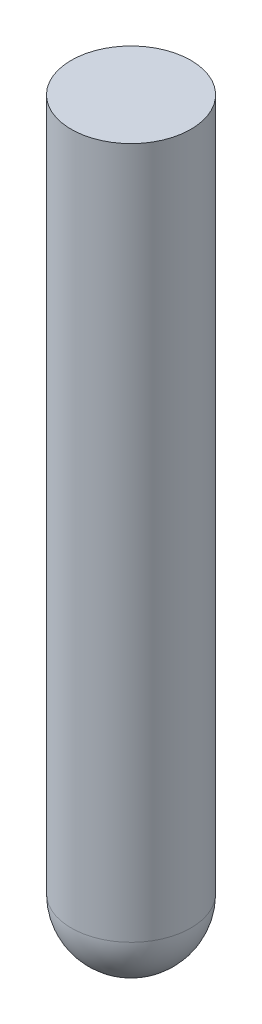
ISO-10303-21;
HEADER;
FILE_DESCRIPTION(('STEP AP214'),'2;1');
FILE_NAME('part.step','',(''),(''),'','','');
FILE_SCHEMA(('AUTOMOTIVE_DESIGN { 1 0 10303 214 1 1 1 1 }'));
ENDSEC;
DATA;
#1=APPLICATION_CONTEXT('core data for automotive mechanical design processes');
#2=APPLICATION_PROTOCOL_DEFINITION('international standard','automotive_design',2000,#1);
#3=PRODUCT_CONTEXT('',#1,'mechanical');
#4=PRODUCT('Part','Part','',(#3));
#5=PRODUCT_RELATED_PRODUCT_CATEGORY('part','',(#4));
#6=PRODUCT_DEFINITION_FORMATION('','',#4);
#7=PRODUCT_DEFINITION_CONTEXT('part definition',#1,'design');
#8=PRODUCT_DEFINITION('design','',#6,#7);
#9=PRODUCT_DEFINITION_SHAPE('','',#8);
#10=(LENGTH_UNIT() NAMED_UNIT(*) SI_UNIT(.MILLI.,.METRE.));
#11=(NAMED_UNIT(*) PLANE_ANGLE_UNIT() SI_UNIT($,.RADIAN.));
#12=(NAMED_UNIT(*) SI_UNIT($,.STERADIAN.) SOLID_ANGLE_UNIT());
#13=UNCERTAINTY_MEASURE_WITH_UNIT(LENGTH_MEASURE(1.E-05),#10,'distance_accuracy_value','');
#14=(GEOMETRIC_REPRESENTATION_CONTEXT(3) GLOBAL_UNCERTAINTY_ASSIGNED_CONTEXT((#13)) GLOBAL_UNIT_ASSIGNED_CONTEXT((#10,
#11,#12)) REPRESENTATION_CONTEXT('',''));
#15=CARTESIAN_POINT('',(0.,0.,0.));
#16=DIRECTION('',(0.,0.,1.));
#17=DIRECTION('',(1.,0.,0.));
#18=AXIS2_PLACEMENT_3D('',#15,#16,#17);
#19=CARTESIAN_POINT('',(0.,32.1246256668385,-75.6998705485108));
#20=DIRECTION('',(0.,-1.,0.));
#21=DIRECTION('',(0.,0.,-1.));
#22=AXIS2_PLACEMENT_3D('',#19,#20,#21);
#23=PLANE('',#22);
#24=CARTESIAN_POINT('',(0.,32.1246256668385,-75.6998705485108));
#25=DIRECTION('',(0.,-1.,0.));
#26=DIRECTION('',(0.,0.,-1.));
#27=AXIS2_PLACEMENT_3D('',#24,#25,#26);
#28=CIRCLE('',#27,0.5);
#29=CARTESIAN_POINT('',(0.,32.1246256668385,-76.1998705485108));
#30=VERTEX_POINT('',#29);
#31=EDGE_CURVE('E44',#30,#30,#28,.T.);
#32=ORIENTED_EDGE('',*,*,#31,.F.);
#33=EDGE_LOOP('',(#32));
#34=FACE_BOUND('',#33,.T.);
#35=ADVANCED_FACE('F38',(#34),#23,.F.);
#36=CARTESIAN_POINT('',(0.,32.1246256668385,-75.6998705485108));
#37=DIRECTION('',(0.,-1.,0.));
#38=DIRECTION('',(0.,0.,-1.));
#39=AXIS2_PLACEMENT_3D('',#36,#37,#38);
#40=CYLINDRICAL_SURFACE('',#39,0.5);
#41=CARTESIAN_POINT('',(0.,26.3431165422794,-75.6998705485108));
#42=DIRECTION('',(0.,-1.,0.));
#43=DIRECTION('',(0.,0.,-1.));
#44=AXIS2_PLACEMENT_3D('',#41,#42,#43);
#45=CIRCLE('',#44,0.5);
#46=CARTESIAN_POINT('',(0.,26.3431165422794,-76.1998705485108));
#47=VERTEX_POINT('',#46);
#48=EDGE_CURVE('E12',#47,#47,#45,.T.);
#49=ORIENTED_EDGE('',*,*,#48,.F.);
#50=EDGE_LOOP('',(#49));
#51=FACE_BOUND('',#50,.T.);
#52=ORIENTED_EDGE('',*,*,#31,.T.);
#53=EDGE_LOOP('',(#52));
#54=FACE_BOUND('',#53,.T.);
#55=ADVANCED_FACE('F49',(#51,#54),#40,.T.);
#56=CARTESIAN_POINT('',(0.,26.3431165422794,-75.6998705485108));
#57=DIRECTION('',(0.,1.,0.));
#58=DIRECTION('',(0.,0.,-1.));
#59=AXIS2_PLACEMENT_3D('',#56,#57,#58);
#60=SPHERICAL_SURFACE('',#59,0.5);
#61=ORIENTED_EDGE('',*,*,#48,.T.);
#62=EDGE_LOOP('',(#61));
#63=FACE_BOUND('',#62,.T.);
#64=ADVANCED_FACE('F51',(#63),#60,.T.);
#65=CLOSED_SHELL('',(#35,#55,#64));
#66=MANIFOLD_SOLID_BREP('B2',#65);
#67=ADVANCED_BREP_SHAPE_REPRESENTATION('',(#18,#66),#14);
#68=SHAPE_DEFINITION_REPRESENTATION(#9,#67);
ENDSEC;
END-ISO-10303-21;
